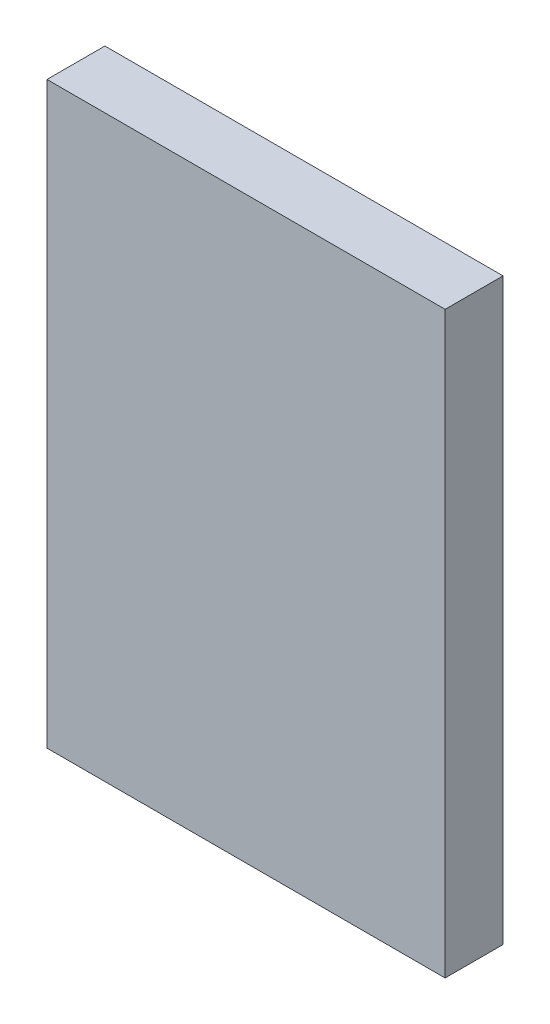
ISO-10303-21;
HEADER;
FILE_DESCRIPTION(('STEP AP214'),'2;1');
FILE_NAME('part.step','',(''),(''),'','','');
FILE_SCHEMA(('AUTOMOTIVE_DESIGN { 1 0 10303 214 1 1 1 1 }'));
ENDSEC;
DATA;
#1=APPLICATION_CONTEXT('core data for automotive mechanical design processes');
#2=APPLICATION_PROTOCOL_DEFINITION('international standard','automotive_design',2000,#1);
#3=PRODUCT_CONTEXT('',#1,'mechanical');
#4=PRODUCT('Part','Part','',(#3));
#5=PRODUCT_RELATED_PRODUCT_CATEGORY('part','',(#4));
#6=PRODUCT_DEFINITION_FORMATION('','',#4);
#7=PRODUCT_DEFINITION_CONTEXT('part definition',#1,'design');
#8=PRODUCT_DEFINITION('design','',#6,#7);
#9=PRODUCT_DEFINITION_SHAPE('','',#8);
#10=(LENGTH_UNIT() NAMED_UNIT(*) SI_UNIT(.MILLI.,.METRE.));
#11=(NAMED_UNIT(*) PLANE_ANGLE_UNIT() SI_UNIT($,.RADIAN.));
#12=(NAMED_UNIT(*) SI_UNIT($,.STERADIAN.) SOLID_ANGLE_UNIT());
#13=UNCERTAINTY_MEASURE_WITH_UNIT(LENGTH_MEASURE(1.E-05),#10,'distance_accuracy_value','');
#14=(GEOMETRIC_REPRESENTATION_CONTEXT(3) GLOBAL_UNCERTAINTY_ASSIGNED_CONTEXT((#13)) GLOBAL_UNIT_ASSIGNED_CONTEXT((#10,
#11,#12)) REPRESENTATION_CONTEXT('',''));
#15=CARTESIAN_POINT('',(0.,0.,0.));
#16=DIRECTION('',(0.,0.,1.));
#17=DIRECTION('',(1.,0.,0.));
#18=AXIS2_PLACEMENT_3D('',#15,#16,#17);
#19=CARTESIAN_POINT('',(166.943744279938,114.06204329235,141.981582908599));
#20=DIRECTION('',(0.,1.,0.));
#21=DIRECTION('',(1.,0.,0.));
#22=AXIS2_PLACEMENT_3D('',#19,#20,#21);
#23=PLANE('',#22);
#24=DIRECTION('',(1.,0.,0.));
#25=VECTOR('',#24,1.);
#26=CARTESIAN_POINT('',(166.943744279938,114.06204329235,141.581582908599));
#27=LINE('',#26,#25);
#28=CARTESIAN_POINT('',(166.943744279938,114.06204329235,141.581582908599));
#29=VERTEX_POINT('',#28);
#30=CARTESIAN_POINT('',(169.693744279938,114.06204329235,141.581582908599));
#31=VERTEX_POINT('',#30);
#32=EDGE_CURVE('E11',#29,#31,#27,.T.);
#33=ORIENTED_EDGE('',*,*,#32,.T.);
#34=DIRECTION('',(0.,0.,-1.));
#35=VECTOR('',#34,1.);
#36=CARTESIAN_POINT('',(169.693744279938,114.06204329235,141.981582908599));
#37=LINE('',#36,#35);
#38=CARTESIAN_POINT('',(169.693744279938,114.06204329235,141.981582908599));
#39=VERTEX_POINT('',#38);
#40=EDGE_CURVE('E66',#39,#31,#37,.T.);
#41=ORIENTED_EDGE('',*,*,#40,.F.);
#42=DIRECTION('',(1.,0.,0.));
#43=VECTOR('',#42,1.);
#44=CARTESIAN_POINT('',(166.943744279938,114.06204329235,141.981582908599));
#45=LINE('',#44,#43);
#46=CARTESIAN_POINT('',(166.943744279938,114.06204329235,141.981582908599));
#47=VERTEX_POINT('',#46);
#48=EDGE_CURVE('E93',#47,#39,#45,.T.);
#49=ORIENTED_EDGE('',*,*,#48,.F.);
#50=DIRECTION('',(0.,0.,-1.));
#51=VECTOR('',#50,1.);
#52=CARTESIAN_POINT('',(166.943744279938,114.06204329235,141.981582908599));
#53=LINE('',#52,#51);
#54=EDGE_CURVE('E54',#47,#29,#53,.T.);
#55=ORIENTED_EDGE('',*,*,#54,.T.);
#56=EDGE_LOOP('',(#33,#41,#49,#55));
#57=FACE_BOUND('',#56,.T.);
#58=ADVANCED_FACE('F44',(#57),#23,.F.);
#59=CARTESIAN_POINT('',(169.693744279938,118.06204329235,141.981582908599));
#60=DIRECTION('',(-1.,0.,0.));
#61=DIRECTION('',(0.,1.,0.));
#62=AXIS2_PLACEMENT_3D('',#59,#60,#61);
#63=PLANE('',#62);
#64=DIRECTION('',(0.,1.,0.));
#65=VECTOR('',#64,1.);
#66=CARTESIAN_POINT('',(169.693744279938,118.06204329235,141.581582908599));
#67=LINE('',#66,#65);
#68=CARTESIAN_POINT('',(169.693744279938,118.06204329235,141.581582908599));
#69=VERTEX_POINT('',#68);
#70=EDGE_CURVE('E108',#31,#69,#67,.T.);
#71=ORIENTED_EDGE('',*,*,#70,.T.);
#72=DIRECTION('',(0.,0.,-1.));
#73=VECTOR('',#72,1.);
#74=CARTESIAN_POINT('',(169.693744279938,118.06204329235,141.981582908599));
#75=LINE('',#74,#73);
#76=CARTESIAN_POINT('',(169.693744279938,118.06204329235,141.981582908599));
#77=VERTEX_POINT('',#76);
#78=EDGE_CURVE('E123',#77,#69,#75,.T.);
#79=ORIENTED_EDGE('',*,*,#78,.F.);
#80=DIRECTION('',(0.,1.,0.));
#81=VECTOR('',#80,1.);
#82=CARTESIAN_POINT('',(169.693744279938,118.06204329235,141.981582908599));
#83=LINE('',#82,#81);
#84=EDGE_CURVE('E98',#39,#77,#83,.T.);
#85=ORIENTED_EDGE('',*,*,#84,.F.);
#86=ORIENTED_EDGE('',*,*,#40,.T.);
#87=EDGE_LOOP('',(#71,#79,#85,#86));
#88=FACE_BOUND('',#87,.T.);
#89=ADVANCED_FACE('F134',(#88),#63,.F.);
#90=CARTESIAN_POINT('',(166.943744279938,118.06204329235,141.981582908599));
#91=DIRECTION('',(0.,-1.,0.));
#92=DIRECTION('',(0.,0.,-1.));
#93=AXIS2_PLACEMENT_3D('',#90,#91,#92);
#94=PLANE('',#93);
#95=DIRECTION('',(-1.,0.,0.));
#96=VECTOR('',#95,1.);
#97=CARTESIAN_POINT('',(166.943744279938,118.06204329235,141.581582908599));
#98=LINE('',#97,#96);
#99=CARTESIAN_POINT('',(166.943744279938,118.06204329235,141.581582908599));
#100=VERTEX_POINT('',#99);
#101=EDGE_CURVE('E47',#69,#100,#98,.T.);
#102=ORIENTED_EDGE('',*,*,#101,.T.);
#103=DIRECTION('',(0.,0.,-1.));
#104=VECTOR('',#103,1.);
#105=CARTESIAN_POINT('',(166.943744279938,118.06204329235,141.981582908599));
#106=LINE('',#105,#104);
#107=CARTESIAN_POINT('',(166.943744279938,118.06204329235,141.981582908599));
#108=VERTEX_POINT('',#107);
#109=EDGE_CURVE('E97',#108,#100,#106,.T.);
#110=ORIENTED_EDGE('',*,*,#109,.F.);
#111=DIRECTION('',(-1.,0.,0.));
#112=VECTOR('',#111,1.);
#113=CARTESIAN_POINT('',(166.943744279938,118.06204329235,141.981582908599));
#114=LINE('',#113,#112);
#115=EDGE_CURVE('E113',#77,#108,#114,.T.);
#116=ORIENTED_EDGE('',*,*,#115,.F.);
#117=ORIENTED_EDGE('',*,*,#78,.T.);
#118=EDGE_LOOP('',(#102,#110,#116,#117));
#119=FACE_BOUND('',#118,.T.);
#120=ADVANCED_FACE('F168',(#119),#94,.F.);
#121=CARTESIAN_POINT('',(166.943744279938,118.06204329235,141.981582908599));
#122=DIRECTION('',(1.,0.,0.));
#123=DIRECTION('',(0.,1.,0.));
#124=AXIS2_PLACEMENT_3D('',#121,#122,#123);
#125=PLANE('',#124);
#126=DIRECTION('',(0.,-1.,0.));
#127=VECTOR('',#126,1.);
#128=CARTESIAN_POINT('',(166.943744279938,118.06204329235,141.581582908599));
#129=LINE('',#128,#127);
#130=EDGE_CURVE('E106',#100,#29,#129,.T.);
#131=ORIENTED_EDGE('',*,*,#130,.T.);
#132=ORIENTED_EDGE('',*,*,#54,.F.);
#133=DIRECTION('',(0.,-1.,0.));
#134=VECTOR('',#133,1.);
#135=CARTESIAN_POINT('',(166.943744279938,118.06204329235,141.981582908599));
#136=LINE('',#135,#134);
#137=EDGE_CURVE('E104',#108,#47,#136,.T.);
#138=ORIENTED_EDGE('',*,*,#137,.F.);
#139=ORIENTED_EDGE('',*,*,#109,.T.);
#140=EDGE_LOOP('',(#131,#132,#138,#139));
#141=FACE_BOUND('',#140,.T.);
#142=ADVANCED_FACE('F103',(#141),#125,.F.);
#143=CARTESIAN_POINT('',(168.318744279938,116.06204329235,141.981582908599));
#144=DIRECTION('',(0.,0.,-1.));
#145=DIRECTION('',(0.,-1.,0.));
#146=AXIS2_PLACEMENT_3D('',#143,#144,#145);
#147=PLANE('',#146);
#148=ORIENTED_EDGE('',*,*,#48,.T.);
#149=ORIENTED_EDGE('',*,*,#84,.T.);
#150=ORIENTED_EDGE('',*,*,#115,.T.);
#151=ORIENTED_EDGE('',*,*,#137,.T.);
#152=EDGE_LOOP('',(#148,#149,#150,#151));
#153=FACE_BOUND('',#152,.T.);
#154=ADVANCED_FACE('F111',(#153),#147,.F.);
#155=CARTESIAN_POINT('',(168.318744279938,116.06204329235,141.581582908599));
#156=DIRECTION('',(0.,0.,-1.));
#157=DIRECTION('',(0.,-1.,0.));
#158=AXIS2_PLACEMENT_3D('',#155,#156,#157);
#159=PLANE('',#158);
#160=ORIENTED_EDGE('',*,*,#32,.F.);
#161=ORIENTED_EDGE('',*,*,#130,.F.);
#162=ORIENTED_EDGE('',*,*,#101,.F.);
#163=ORIENTED_EDGE('',*,*,#70,.F.);
#164=EDGE_LOOP('',(#160,#161,#162,#163));
#165=FACE_BOUND('',#164,.T.);
#166=ADVANCED_FACE('F137',(#165),#159,.T.);
#167=CLOSED_SHELL('',(#58,#89,#120,#142,#154,#166));
#168=MANIFOLD_SOLID_BREP('B2',#167);
#169=ADVANCED_BREP_SHAPE_REPRESENTATION('',(#18,#168),#14);
#170=SHAPE_DEFINITION_REPRESENTATION(#9,#169);
ENDSEC;
END-ISO-10303-21;
